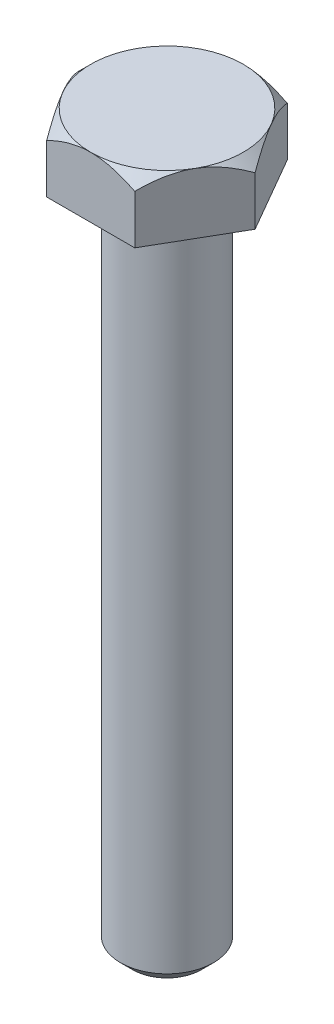
ISO-10303-21;
HEADER;
FILE_DESCRIPTION(('STEP AP214'),'2;1');
FILE_NAME('part.step','',(''),(''),'','','');
FILE_SCHEMA(('AUTOMOTIVE_DESIGN { 1 0 10303 214 1 1 1 1 }'));
ENDSEC;
DATA;
#1=APPLICATION_CONTEXT('core data for automotive mechanical design processes');
#2=APPLICATION_PROTOCOL_DEFINITION('international standard','automotive_design',2000,#1);
#3=PRODUCT_CONTEXT('',#1,'mechanical');
#4=PRODUCT('Part','Part','',(#3));
#5=PRODUCT_RELATED_PRODUCT_CATEGORY('part','',(#4));
#6=PRODUCT_DEFINITION_FORMATION('','',#4);
#7=PRODUCT_DEFINITION_CONTEXT('part definition',#1,'design');
#8=PRODUCT_DEFINITION('design','',#6,#7);
#9=PRODUCT_DEFINITION_SHAPE('','',#8);
#10=(LENGTH_UNIT() NAMED_UNIT(*) SI_UNIT(.MILLI.,.METRE.));
#11=(NAMED_UNIT(*) PLANE_ANGLE_UNIT() SI_UNIT($,.RADIAN.));
#12=(NAMED_UNIT(*) SI_UNIT($,.STERADIAN.) SOLID_ANGLE_UNIT());
#13=UNCERTAINTY_MEASURE_WITH_UNIT(LENGTH_MEASURE(1.E-05),#10,'distance_accuracy_value','');
#14=(GEOMETRIC_REPRESENTATION_CONTEXT(3) GLOBAL_UNCERTAINTY_ASSIGNED_CONTEXT((#13)) GLOBAL_UNIT_ASSIGNED_CONTEXT((#10,
#11,#12)) REPRESENTATION_CONTEXT('',''));
#15=CARTESIAN_POINT('',(0.,0.,0.));
#16=DIRECTION('',(0.,0.,1.));
#17=DIRECTION('',(1.,0.,0.));
#18=AXIS2_PLACEMENT_3D('',#15,#16,#17);
#19=CARTESIAN_POINT('',(3.62500000000007,5.,6.27868417743714));
#20=DIRECTION('',(-0.866025403784442,0.,-0.499999999999995));
#21=DIRECTION('',(-0.499999999999995,0.,0.866025403784442));
#22=AXIS2_PLACEMENT_3D('',#19,#20,#21);
#23=PLANE('',#22);
#24=CARTESIAN_POINT('',(3.62488452994624,4.02856870462476,6.27888417743714));
#25=CARTESIAN_POINT('',(3.68721389664161,4.0908916934917,6.17092654751716));
#26=CARTESIAN_POINT('',(3.75002235616352,4.15130208102734,6.06213910448007));
#27=CARTESIAN_POINT('',(3.87669145105401,4.2677158493395,5.84274179638098));
#28=CARTESIAN_POINT('',(3.94055263837515,4.32371682320785,5.73213097530909));
#29=CARTESIAN_POINT('',(4.13444955410337,4.48471046563524,5.39629166583691));
#30=CARTESIAN_POINT('',(4.26612670995196,4.58200705628878,5.16822014171098));
#31=CARTESIAN_POINT('',(4.53166422082633,4.74862075095615,4.70829568156119));
#32=CARTESIAN_POINT('',(4.66545670737727,4.81835760873348,4.47656029718399));
#33=CARTESIAN_POINT('',(4.86834501872006,4.89902600771869,4.12514743367641));
#34=CARTESIAN_POINT('',(4.93627316062514,4.92191520494596,4.00749244063306));
#35=CARTESIAN_POINT('',(5.07270459498125,4.95919667933445,3.77118626457879));
#36=CARTESIAN_POINT('',(5.14120779992591,4.97359022631844,3.65253523313333));
#37=CARTESIAN_POINT('',(5.30814078917526,4.99772308228725,3.3633988142941));
#38=CARTESIAN_POINT('',(5.40675043702598,5.0027866000747,3.19260189410018));
#39=CARTESIAN_POINT('',(5.60379200256286,4.99428769024785,2.85131589138739));
#40=CARTESIAN_POINT('',(5.70222384583931,4.98071873353769,2.68082693774991));
#41=CARTESIAN_POINT('',(5.89815953180448,4.9357547130673,2.34145637464237));
#42=CARTESIAN_POINT('',(5.99566221252046,4.9043397144273,2.17257677776813));
#43=CARTESIAN_POINT('',(6.18899174051392,4.82539152715257,1.83772021268014));
#44=CARTESIAN_POINT('',(6.28481871570106,4.77785957445157,1.67174302292037));
#45=CARTESIAN_POINT('',(6.45492849942725,4.68007191376467,1.37710423464204));
#46=CARTESIAN_POINT('',(6.52958798795453,4.63238802285783,1.2477902072457));
#47=CARTESIAN_POINT('',(6.67756674436656,4.52933616008443,0.991483482699198));
#48=CARTESIAN_POINT('',(6.75088597153632,4.47396795521828,0.864490856069481));
#49=CARTESIAN_POINT('',(6.89595327454856,4.35678861091045,0.613226916735296));
#50=CARTESIAN_POINT('',(6.96770547617939,4.29499773307909,0.488948457955774));
#51=CARTESIAN_POINT('',(7.10988123305974,4.16578428211806,0.24269282343444));
#52=CARTESIAN_POINT('',(7.18030557110013,4.09836516278837,0.120714291859081));
#53=CARTESIAN_POINT('',(7.25011547005384,4.02856870462477,-0.000200000000000499));
#54=B_SPLINE_CURVE_WITH_KNOTS('',3,(#24,#25,#26,#27,#28,#29,#30,#31,#32,#33,#34,#35,#36,#37,#38,
#39,#40,#41,#42,#43,#44,#45,#46,#47,#48,#49,#50,#51,#52,#53),.UNSPECIFIED.,.F.,.F.,(4,2,2,2,2,2,
2,2,2,2,2,2,2,2,4),(0.,0.418085081925561,0.83639681869771,1.67753646991016,2.50531966073267,
2.91839943514191,3.33141745194524,3.9223507147329,4.51349110216463,5.10529312372582,
5.69704977302065,6.16707290687592,6.63711029563191,7.10570744431351,7.57401912040438),.UNSPECIFIED.);
#55=CARTESIAN_POINT('',(3.62500000000007,4.02868417743718,6.27868417743714));
#56=VERTEX_POINT('',#55);
#57=CARTESIAN_POINT('',(5.43750000000002,5.,3.13934208871856));
#58=VERTEX_POINT('',#57);
#59=EDGE_CURVE('E110',#56,#58,#54,.T.);
#60=ORIENTED_EDGE('',*,*,#59,.F.);
#61=DIRECTION('',(0.,-1.,0.));
#62=VECTOR('',#61,1.);
#63=CARTESIAN_POINT('',(3.62500000000007,5.,6.27868417743714));
#64=LINE('',#63,#62);
#65=CARTESIAN_POINT('',(3.62500000000007,0.,6.27868417743714));
#66=VERTEX_POINT('',#65);
#67=EDGE_CURVE('E59',#56,#66,#64,.T.);
#68=ORIENTED_EDGE('',*,*,#67,.T.);
#69=DIRECTION('',(0.499999999999995,0.,-0.866025403784442));
#70=VECTOR('',#69,1.);
#71=CARTESIAN_POINT('',(3.62500000000007,0.,6.27868417743714));
#72=LINE('',#71,#70);
#73=CARTESIAN_POINT('',(7.25,0.,0.));
#74=VERTEX_POINT('',#73);
#75=EDGE_CURVE('E117',#66,#74,#72,.T.);
#76=ORIENTED_EDGE('',*,*,#75,.T.);
#77=DIRECTION('',(0.,-1.,0.));
#78=VECTOR('',#77,1.);
#79=CARTESIAN_POINT('',(7.25,5.,0.));
#80=LINE('',#79,#78);
#81=CARTESIAN_POINT('',(7.25,4.02868417743718,0.));
#82=VERTEX_POINT('',#81);
#83=EDGE_CURVE('E135',#82,#74,#80,.T.);
#84=ORIENTED_EDGE('',*,*,#83,.F.);
#85=EDGE_CURVE('E118',#58,#82,#54,.T.);
#86=ORIENTED_EDGE('',*,*,#85,.F.);
#87=EDGE_LOOP('',(#60,#68,#76,#84,#86));
#88=FACE_BOUND('',#87,.T.);
#89=ADVANCED_FACE('F36',(#88),#23,.F.);
#90=CARTESIAN_POINT('',(7.25,5.,0.));
#91=DIRECTION('',(-0.866025403784438,0.,0.500000000000001));
#92=DIRECTION('',(0.500000000000001,0.,0.866025403784438));
#93=AXIS2_PLACEMENT_3D('',#90,#91,#92);
#94=PLANE('',#93);
#95=CARTESIAN_POINT('',(7.25011547005384,4.02856870462477,0.000200000000000034));
#96=CARTESIAN_POINT('',(7.18778610335847,4.0908916934917,-0.107757629919975));
#97=CARTESIAN_POINT('',(7.12497764383655,4.15130208102734,-0.21654507295707));
#98=CARTESIAN_POINT('',(6.99830854894606,4.2677158493395,-0.435942381056166));
#99=CARTESIAN_POINT('',(6.93444736162492,4.32371682320785,-0.546553202128054));
#100=CARTESIAN_POINT('',(6.7405504458967,4.48471046563526,-0.882392511600232));
#101=CARTESIAN_POINT('',(6.6088732900481,4.58200705628879,-1.11046403572617));
#102=CARTESIAN_POINT('',(6.34333577917372,4.74862075095617,-1.57038849587596));
#103=CARTESIAN_POINT('',(6.20954329262278,4.8183576087335,-1.80212388025316));
#104=CARTESIAN_POINT('',(6.00665498127998,4.89902600771871,-2.15353674376074));
#105=CARTESIAN_POINT('',(5.9387268393749,4.92191520494598,-2.27119173680409));
#106=CARTESIAN_POINT('',(5.80229540501879,4.95919667933447,-2.50749791285837));
#107=CARTESIAN_POINT('',(5.73379220007413,4.97359022631846,-2.62614894430383));
#108=CARTESIAN_POINT('',(5.56685921082478,4.99772308228727,-2.91528536314305));
#109=CARTESIAN_POINT('',(5.46824956297406,5.00278660007473,-3.08608228333698));
#110=CARTESIAN_POINT('',(5.27120799743718,4.99428769024788,-3.42736828604976));
#111=CARTESIAN_POINT('',(5.17277615416072,4.98071873353772,-3.59785723968724));
#112=CARTESIAN_POINT('',(4.97684046819555,4.93575471306732,-3.93722780279478));
#113=CARTESIAN_POINT('',(4.87933778747957,4.90433971442733,-4.10610739966901));
#114=CARTESIAN_POINT('',(4.68600825948611,4.8253915271526,-4.44096396475701));
#115=CARTESIAN_POINT('',(4.59018128429897,4.7778595744516,-4.60694115451677));
#116=CARTESIAN_POINT('',(4.42007150057277,4.68007191376469,-4.9015799427951));
#117=CARTESIAN_POINT('',(4.34541201204549,4.63238802285786,-5.03089397019145));
#118=CARTESIAN_POINT('',(4.19743325563346,4.52933616008445,-5.28720069473796));
#119=CARTESIAN_POINT('',(4.12411402846369,4.4739679552183,-5.41419332136768));
#120=CARTESIAN_POINT('',(3.97904672545145,4.35678861091046,-5.66545726070187));
#121=CARTESIAN_POINT('',(3.90729452382061,4.2949977330791,-5.7897357194814));
#122=CARTESIAN_POINT('',(3.76511876694025,4.16578428211807,-6.03599135400274));
#123=CARTESIAN_POINT('',(3.69469442889986,4.09836516278837,-6.1579698855781));
#124=CARTESIAN_POINT('',(3.62488452994615,4.02856870462476,-6.27888417743719));
#125=B_SPLINE_CURVE_WITH_KNOTS('',3,(#95,#96,#97,#98,#99,#100,#101,#102,#103,#104,#105,#106,
#107,#108,#109,#110,#111,#112,#113,#114,#115,#116,#117,#118,#119,#120,#121,#122,#123,#124),
.UNSPECIFIED.,.F.,.F.,(4,2,2,2,2,2,2,2,2,2,2,2,2,2,4),(0.,0.418085081925567,0.83639681869772,
1.67753646991019,2.5053196607327,2.91839943514195,3.33141745194528,3.92235071473293,
4.51349110216466,5.10529312372585,5.69704977302068,6.16707290687597,6.63711029563198,
7.1057074443136,7.57401912040448),.UNSPECIFIED.);
#126=CARTESIAN_POINT('',(5.43749999999999,5.,-3.13934208871859));
#127=VERTEX_POINT('',#126);
#128=EDGE_CURVE('E125',#82,#127,#125,.T.);
#129=ORIENTED_EDGE('',*,*,#128,.F.);
#130=ORIENTED_EDGE('',*,*,#83,.T.);
#131=DIRECTION('',(-0.500000000000001,0.,-0.866025403784438));
#132=VECTOR('',#131,1.);
#133=CARTESIAN_POINT('',(7.25,0.,0.));
#134=LINE('',#133,#132);
#135=CARTESIAN_POINT('',(3.62499999999999,0.,-6.27868417743719));
#136=VERTEX_POINT('',#135);
#137=EDGE_CURVE('E398',#74,#136,#134,.T.);
#138=ORIENTED_EDGE('',*,*,#137,.T.);
#139=DIRECTION('',(0.,-1.,0.));
#140=VECTOR('',#139,1.);
#141=CARTESIAN_POINT('',(3.62499999999999,5.,-6.27868417743719));
#142=LINE('',#141,#140);
#143=CARTESIAN_POINT('',(3.62499999999999,4.02868417743718,-6.27868417743719));
#144=VERTEX_POINT('',#143);
#145=EDGE_CURVE('E204',#144,#136,#142,.T.);
#146=ORIENTED_EDGE('',*,*,#145,.F.);
#147=EDGE_CURVE('E136',#127,#144,#125,.T.);
#148=ORIENTED_EDGE('',*,*,#147,.F.);
#149=EDGE_LOOP('',(#129,#130,#138,#146,#148));
#150=FACE_BOUND('',#149,.T.);
#151=ADVANCED_FACE('F192',(#150),#94,.F.);
#152=CARTESIAN_POINT('',(3.62499999999999,5.,-6.27868417743719));
#153=DIRECTION('',(0.,0.,1.));
#154=DIRECTION('',(1.,0.,0.));
#155=AXIS2_PLACEMENT_3D('',#152,#153,#154);
#156=PLANE('',#155);
#157=CARTESIAN_POINT('',(-7.57666051860033,1.43857952280487,-6.27868417743715));
#158=CARTESIAN_POINT('',(-7.39365651230783,1.57945688959872,-6.27868417743715));
#159=CARTESIAN_POINT('',(-7.20966776392706,1.71907512434262,-6.27868417743715));
#160=CARTESIAN_POINT('',(-6.83931781583867,1.99521769306877,-6.27868417743715));
#161=CARTESIAN_POINT('',(-6.65295606622731,2.13174128876494,-6.27868417743715));
#162=CARTESIAN_POINT('',(-6.27609540777261,2.40209046760801,-6.27868417743715));
#163=CARTESIAN_POINT('',(-6.08557567548029,2.53588711812094,-6.27868417743715));
#164=CARTESIAN_POINT('',(-5.7013676758548,2.79883528544532,-6.27868417743716));
#165=CARTESIAN_POINT('',(-5.50767962786199,2.92798712185071,-6.27868417743716));
#166=CARTESIAN_POINT('',(-5.10415932230891,3.18862292545138,-6.27868417743716));
#167=CARTESIAN_POINT('',(-4.89408397797518,3.31973242959604,-6.27868417743716));
#168=CARTESIAN_POINT('',(-4.46899924146733,3.57382963916996,-6.27868417743716));
#169=CARTESIAN_POINT('',(-4.25398902548427,3.69681597506302,-6.27868417743716));
#170=CARTESIAN_POINT('',(-3.81897305439861,3.93204888921299,-6.27868417743716));
#171=CARTESIAN_POINT('',(-3.59898447967616,4.04432699068524,-6.27868417743716));
#172=CARTESIAN_POINT('',(-3.15278127156474,4.25562782816849,-6.27868417743717));
#173=CARTESIAN_POINT('',(-2.92656964053751,4.35465682564157,-6.27868417743717));
#174=CARTESIAN_POINT('',(-2.49021164331831,4.52687246842811,-6.27868417743717));
#175=CARTESIAN_POINT('',(-2.28069897147736,4.60164844585029,-6.27868417743717));
#176=CARTESIAN_POINT('',(-1.85632597962451,4.73443118921241,-6.27868417743717));
#177=CARTESIAN_POINT('',(-1.64146532079161,4.79243688972169,-6.27868417743717));
#178=CARTESIAN_POINT('',(-1.21142765694939,4.8875683886695,-6.27868417743717));
#179=CARTESIAN_POINT('',(-0.996336148218653,4.9250741683904,-6.27868417743717));
#180=CARTESIAN_POINT('',(-0.56346815275014,4.97842167925469,-6.27868417743717));
#181=CARTESIAN_POINT('',(-0.345692236177016,4.99426793349426,-6.27868417743717));
#182=CARTESIAN_POINT('',(0.0807362217716663,5.0029407360174,-6.27868417743718));
#183=CARTESIAN_POINT('',(0.289368982497101,4.99674859993676,-6.27868417743718));
#184=CARTESIAN_POINT('',(0.705011615215947,4.96394190845027,-6.27868417743718));
#185=CARTESIAN_POINT('',(0.912021338466265,4.9373255028629,-6.27868417743718));
#186=CARTESIAN_POINT('',(1.3264284221839,4.86472465401487,-6.27868417743718));
#187=CARTESIAN_POINT('',(1.53376477368789,4.81839783409703,-6.27868417743718));
#188=CARTESIAN_POINT('',(1.94386969783723,4.70894974197332,-6.27868417743718));
#189=CARTESIAN_POINT('',(2.14663852486609,4.64582940758558,-6.27868417743718));
#190=CARTESIAN_POINT('',(2.55855272468635,4.5016094654899,-6.27868417743719));
#191=CARTESIAN_POINT('',(2.76740928890636,4.41969434988626,-6.27868417743719));
#192=CARTESIAN_POINT('',(3.17975166734441,4.24320663783212,-6.27868417743719));
#193=CARTESIAN_POINT('',(3.38323501259331,4.14862833983322,-6.27868417743719));
#194=CARTESIAN_POINT('',(3.78579095692702,3.94905699505205,-6.27868417743719));
#195=CARTESIAN_POINT('',(3.98484753290937,3.84403189037483,-6.27868417743719));
#196=CARTESIAN_POINT('',(4.37839993765141,3.62587782327072,-6.27868417743719));
#197=CARTESIAN_POINT('',(4.57289646186356,3.51275010738356,-6.27868417743719));
#198=CARTESIAN_POINT('',(4.94842033299621,3.28571869098054,-6.27868417743719));
#199=CARTESIAN_POINT('',(5.12963857253774,3.17212907012057,-6.27868417743719));
#200=CARTESIAN_POINT('',(5.48896153359933,2.94011331347926,-6.2786841774372));
#201=CARTESIAN_POINT('',(5.66706602033122,2.82168681520702,-6.2786841774372));
#202=CARTESIAN_POINT('',(6.01913728036014,2.5818234603211,-6.2786841774372));
#203=CARTESIAN_POINT('',(6.19312579011556,2.46041839375126,-6.2786841774372));
#204=CARTESIAN_POINT('',(6.5387156854476,2.2143526316317,-6.2786841774372));
#205=CARTESIAN_POINT('',(6.71031771587599,2.08969284280949,-6.2786841774372));
#206=CARTESIAN_POINT('',(6.88091860823282,1.96370076934005,-6.2786841774372));
#207=B_SPLINE_CURVE_WITH_KNOTS('',3,(#157,#158,#159,#160,#161,#162,#163,#164,#165,#166,#167,
#168,#169,#170,#171,#172,#173,#174,#175,#176,#177,#178,#179,#180,#181,#182,#183,#184,#185,#186,
#187,#188,#189,#190,#191,#192,#193,#194,#195,#196,#197,#198,#199,#200,#201,#202,#203,#204,#205,
#206),.UNSPECIFIED.,.F.,.F.,(4,2,2,2,2,2,2,2,2,2,2,2,2,2,2,2,2,2,2,2,2,2,2,2,4),(0.,
0.692856158772512,1.38587590819399,2.0842410666755,2.78255808072084,3.52530650890354,
4.26817984375935,5.00879403011467,5.74905696003691,6.41585238613356,7.08269016503529,
7.73670784074358,8.39058891895184,9.01572562815278,9.64091897355062,10.2774464921539,
10.9139384719306,11.586461232698,12.2592878189047,12.9342468231889,13.6091022110665,
14.2506381722582,14.8922223007264,15.5286570401769,16.1649163294069),.UNSPECIFIED.);
#208=CARTESIAN_POINT('',(0.,5.,-6.27868417743718));
#209=VERTEX_POINT('',#208);
#210=EDGE_CURVE('E186',#144,#209,#207,.F.);
#211=ORIENTED_EDGE('',*,*,#210,.F.);
#212=ORIENTED_EDGE('',*,*,#145,.T.);
#213=DIRECTION('',(-1.,0.,0.));
#214=VECTOR('',#213,1.);
#215=CARTESIAN_POINT('',(3.62499999999999,0.,-6.27868417743719));
#216=LINE('',#215,#214);
#217=CARTESIAN_POINT('',(-3.62500000000003,0.,-6.27868417743716));
#218=VERTEX_POINT('',#217);
#219=EDGE_CURVE('E222',#136,#218,#216,.T.);
#220=ORIENTED_EDGE('',*,*,#219,.T.);
#221=DIRECTION('',(0.,-1.,0.));
#222=VECTOR('',#221,1.);
#223=CARTESIAN_POINT('',(-3.62500000000003,5.,-6.27868417743716));
#224=LINE('',#223,#222);
#225=CARTESIAN_POINT('',(-3.62500000000003,4.02868417743718,-6.27868417743716));
#226=VERTEX_POINT('',#225);
#227=EDGE_CURVE('E220',#226,#218,#224,.T.);
#228=ORIENTED_EDGE('',*,*,#227,.F.);
#229=EDGE_CURVE('E181',#209,#226,#207,.F.);
#230=ORIENTED_EDGE('',*,*,#229,.F.);
#231=EDGE_LOOP('',(#211,#212,#220,#228,#230));
#232=FACE_BOUND('',#231,.T.);
#233=ADVANCED_FACE('F188',(#232),#156,.F.);
#234=CARTESIAN_POINT('',(-3.62500000000003,5.,-6.27868417743716));
#235=DIRECTION('',(0.866025403784442,0.,0.499999999999995));
#236=DIRECTION('',(0.499999999999995,0.,-0.866025403784442));
#237=AXIS2_PLACEMENT_3D('',#234,#235,#236);
#238=PLANE('',#237);
#239=CARTESIAN_POINT('',(-3.62488452994619,4.02856870462477,-6.27888417743716));
#240=CARTESIAN_POINT('',(-3.68721389664156,4.0908916934917,-6.17092654751719));
#241=CARTESIAN_POINT('',(-3.75002235616348,4.15130208102734,-6.06213910448009));
#242=CARTESIAN_POINT('',(-3.87669145105397,4.2677158493395,-5.842741796381));
#243=CARTESIAN_POINT('',(-3.94055263837511,4.32371682320785,-5.73213097530911));
#244=CARTESIAN_POINT('',(-4.13444955410333,4.48471046563526,-5.39629166583693));
#245=CARTESIAN_POINT('',(-4.26612670995192,4.58200705628879,-5.16822014171099));
#246=CARTESIAN_POINT('',(-4.5316642208263,4.74862075095617,-4.7082956815612));
#247=CARTESIAN_POINT('',(-4.66545670737723,4.8183576087335,-4.476560297184));
#248=CARTESIAN_POINT('',(-4.86834501872003,4.89902600771871,-4.12514743367642));
#249=CARTESIAN_POINT('',(-4.93627316062511,4.92191520494598,-4.00749244063306));
#250=CARTESIAN_POINT('',(-5.07270459498122,4.95919667933447,-3.77118626457879));
#251=CARTESIAN_POINT('',(-5.14120779992588,4.97359022631847,-3.65253523313333));
#252=CARTESIAN_POINT('',(-5.30814078917523,4.99772308228727,-3.3633988142941));
#253=CARTESIAN_POINT('',(-5.40675043702595,5.00278660007473,-3.19260189410018));
#254=CARTESIAN_POINT('',(-5.60379200256283,4.99428769024788,-2.85131589138739));
#255=CARTESIAN_POINT('',(-5.70222384583928,4.98071873353772,-2.68082693774991));
#256=CARTESIAN_POINT('',(-5.89815953180445,4.93575471306732,-2.34145637464237));
#257=CARTESIAN_POINT('',(-5.99566221252043,4.90433971442733,-2.17257677776813));
#258=CARTESIAN_POINT('',(-6.18899174051389,4.8253915271526,-1.83772021268014));
#259=CARTESIAN_POINT('',(-6.28481871570103,4.7778595744516,-1.67174302292038));
#260=CARTESIAN_POINT('',(-6.45492849942722,4.68007191376469,-1.37710423464204));
#261=CARTESIAN_POINT('',(-6.5295879879545,4.63238802285786,-1.24779020724569));
#262=CARTESIAN_POINT('',(-6.67756674436654,4.52933616008446,-0.991483482699183));
#263=CARTESIAN_POINT('',(-6.7508859715363,4.4739679552183,-0.864490856069462));
#264=CARTESIAN_POINT('',(-6.89595327454855,4.35678861091046,-0.613226916735267));
#265=CARTESIAN_POINT('',(-6.96770547617938,4.2949977330791,-0.488948457955741));
#266=CARTESIAN_POINT('',(-7.10988123305973,4.16578428211807,-0.242692823434398));
#267=CARTESIAN_POINT('',(-7.18030557110012,4.09836516278837,-0.120714291859035));
#268=CARTESIAN_POINT('',(-7.25011547005384,4.02856870462476,0.000200000000050344));
#269=B_SPLINE_CURVE_WITH_KNOTS('',3,(#239,#240,#241,#242,#243,#244,#245,#246,#247,#248,#249,
#250,#251,#252,#253,#254,#255,#256,#257,#258,#259,#260,#261,#262,#263,#264,#265,#266,#267,#268),
.UNSPECIFIED.,.F.,.F.,(4,2,2,2,2,2,2,2,2,2,2,2,2,2,4),(0.,0.418085081925566,0.836396818697719,
1.67753646991018,2.5053196607327,2.91839943514195,3.33141745194527,3.92235071473293,
4.51349110216466,5.10529312372584,5.69704977302067,6.16707290687597,6.63711029563198,
7.1057074443136,7.57401912040448),.UNSPECIFIED.);
#270=CARTESIAN_POINT('',(-5.43750000000001,5.,-3.13934208871856));
#271=VERTEX_POINT('',#270);
#272=EDGE_CURVE('E187',#226,#271,#269,.T.);
#273=ORIENTED_EDGE('',*,*,#272,.F.);
#274=ORIENTED_EDGE('',*,*,#227,.T.);
#275=DIRECTION('',(-0.499999999999995,0.,0.866025403784441));
#276=VECTOR('',#275,1.);
#277=CARTESIAN_POINT('',(-3.62500000000003,0.,-6.27868417743716));
#278=LINE('',#277,#276);
#279=CARTESIAN_POINT('',(-7.25,0.,0.));
#280=VERTEX_POINT('',#279);
#281=EDGE_CURVE('E396',#218,#280,#278,.T.);
#282=ORIENTED_EDGE('',*,*,#281,.T.);
#283=DIRECTION('',(0.,-1.,0.));
#284=VECTOR('',#283,1.);
#285=CARTESIAN_POINT('',(-7.25,5.,0.));
#286=LINE('',#285,#284);
#287=CARTESIAN_POINT('',(-7.25,4.02868417743718,0.));
#288=VERTEX_POINT('',#287);
#289=EDGE_CURVE('E226',#288,#280,#286,.T.);
#290=ORIENTED_EDGE('',*,*,#289,.F.);
#291=EDGE_CURVE('E176',#271,#288,#269,.T.);
#292=ORIENTED_EDGE('',*,*,#291,.F.);
#293=EDGE_LOOP('',(#273,#274,#282,#290,#292));
#294=FACE_BOUND('',#293,.T.);
#295=ADVANCED_FACE('F191',(#294),#238,.F.);
#296=CARTESIAN_POINT('',(-7.25,5.,0.));
#297=DIRECTION('',(0.866025403784435,0.,-0.500000000000007));
#298=DIRECTION('',(-0.500000000000007,0.,-0.866025403784435));
#299=AXIS2_PLACEMENT_3D('',#296,#297,#298);
#300=PLANE('',#299);
#301=CARTESIAN_POINT('',(-7.25011547005384,4.02856870462477,-0.000199999999949406));
#302=CARTESIAN_POINT('',(-7.18778610335847,4.0908916934917,0.107757629920025));
#303=CARTESIAN_POINT('',(-7.12497764383655,4.15130208102734,0.216545072957119));
#304=CARTESIAN_POINT('',(-6.99830854894605,4.2677158493395,0.435942381056215));
#305=CARTESIAN_POINT('',(-6.93444736162491,4.32371682320785,0.546553202128102));
#306=CARTESIAN_POINT('',(-6.74055044589669,4.48471046563525,0.882392511600279));
#307=CARTESIAN_POINT('',(-6.60887329004809,4.58200705628879,1.11046403572621));
#308=CARTESIAN_POINT('',(-6.34333577917371,4.74862075095617,1.570388495876));
#309=CARTESIAN_POINT('',(-6.20954329262277,4.8183576087335,1.8021238802532));
#310=CARTESIAN_POINT('',(-6.00665498127997,4.89902600771871,2.15353674376078));
#311=CARTESIAN_POINT('',(-5.93872683937489,4.92191520494598,2.27119173680413));
#312=CARTESIAN_POINT('',(-5.80229540501878,4.95919667933447,2.50749791285841));
#313=CARTESIAN_POINT('',(-5.73379220007411,4.97359022631847,2.62614894430387));
#314=CARTESIAN_POINT('',(-5.56685921082476,4.99772308228727,2.91528536314309));
#315=CARTESIAN_POINT('',(-5.46824956297404,5.00278660007473,3.08608228333701));
#316=CARTESIAN_POINT('',(-5.27120799743715,4.99428769024788,3.4273682860498));
#317=CARTESIAN_POINT('',(-5.1727761541607,4.98071873353772,3.59785723968728));
#318=CARTESIAN_POINT('',(-4.97684046819552,4.93575471306732,3.93722780279481));
#319=CARTESIAN_POINT('',(-4.87933778747955,4.90433971442733,4.10610739966905));
#320=CARTESIAN_POINT('',(-4.68600825948608,4.8253915271526,4.44096396475704));
#321=CARTESIAN_POINT('',(-4.59018128429894,4.7778595744516,4.6069411545168));
#322=CARTESIAN_POINT('',(-4.42007150057274,4.68007191376469,4.90157994279513));
#323=CARTESIAN_POINT('',(-4.34541201204546,4.63238802285786,5.03089397019148));
#324=CARTESIAN_POINT('',(-4.19743325563342,4.52933616008446,5.28720069473799));
#325=CARTESIAN_POINT('',(-4.12411402846365,4.4739679552183,5.41419332136771));
#326=CARTESIAN_POINT('',(-3.9790467254514,4.35678861091047,5.6654572607019));
#327=CARTESIAN_POINT('',(-3.90729452382057,4.2949977330791,5.78973571948143));
#328=CARTESIAN_POINT('',(-3.76511876694021,4.16578428211807,6.03599135400277));
#329=CARTESIAN_POINT('',(-3.69469442889982,4.09836516278837,6.15796988557813));
#330=CARTESIAN_POINT('',(-3.6248845299461,4.02856870462477,6.27888417743721));
#331=B_SPLINE_CURVE_WITH_KNOTS('',3,(#301,#302,#303,#304,#305,#306,#307,#308,#309,#310,#311,
#312,#313,#314,#315,#316,#317,#318,#319,#320,#321,#322,#323,#324,#325,#326,#327,#328,#329,#330),
.UNSPECIFIED.,.F.,.F.,(4,2,2,2,2,2,2,2,2,2,2,2,2,2,4),(0.,0.418085081925566,0.836396818697719,
1.67753646991019,2.50531966073269,2.91839943514195,3.33141745194527,3.92235071473293,
4.51349110216466,5.10529312372585,5.69704977302068,6.16707290687597,6.63711029563198,
7.1057074443136,7.57401912040449),.UNSPECIFIED.);
#332=CARTESIAN_POINT('',(-5.43749999999997,5.,3.13934208871863));
#333=VERTEX_POINT('',#332);
#334=EDGE_CURVE('E381',#288,#333,#331,.T.);
#335=ORIENTED_EDGE('',*,*,#334,.F.);
#336=ORIENTED_EDGE('',*,*,#289,.T.);
#337=DIRECTION('',(0.500000000000007,0.,0.866025403784434));
#338=VECTOR('',#337,1.);
#339=CARTESIAN_POINT('',(-7.25,0.,0.));
#340=LINE('',#339,#338);
#341=CARTESIAN_POINT('',(-3.62499999999994,0.,6.27868417743721));
#342=VERTEX_POINT('',#341);
#343=EDGE_CURVE('E389',#280,#342,#340,.T.);
#344=ORIENTED_EDGE('',*,*,#343,.T.);
#345=DIRECTION('',(0.,-1.,0.));
#346=VECTOR('',#345,1.);
#347=CARTESIAN_POINT('',(-3.62499999999994,5.,6.27868417743721));
#348=LINE('',#347,#346);
#349=CARTESIAN_POINT('',(-3.62499999999994,4.02868417743718,6.27868417743721));
#350=VERTEX_POINT('',#349);
#351=EDGE_CURVE('E229',#350,#342,#348,.T.);
#352=ORIENTED_EDGE('',*,*,#351,.F.);
#353=EDGE_CURVE('E169',#333,#350,#331,.T.);
#354=ORIENTED_EDGE('',*,*,#353,.F.);
#355=EDGE_LOOP('',(#335,#336,#344,#352,#354));
#356=FACE_BOUND('',#355,.T.);
#357=ADVANCED_FACE('F309',(#356),#300,.F.);
#358=CARTESIAN_POINT('',(-3.62499999999994,5.,6.27868417743721));
#359=DIRECTION('',(0.,0.,-1.));
#360=DIRECTION('',(-1.,0.,0.));
#361=AXIS2_PLACEMENT_3D('',#358,#359,#360);
#362=PLANE('',#361);
#363=CARTESIAN_POINT('',(-7.57666051860024,1.43857952280487,6.27868417743725));
#364=CARTESIAN_POINT('',(-7.39365651230774,1.57945688959872,6.27868417743725));
#365=CARTESIAN_POINT('',(-7.20966776392697,1.71907512434262,6.27868417743725));
#366=CARTESIAN_POINT('',(-6.83931781583858,1.99521769306878,6.27868417743725));
#367=CARTESIAN_POINT('',(-6.65295606622722,2.13174128876494,6.27868417743725));
#368=CARTESIAN_POINT('',(-6.27609540777252,2.40209046760801,6.27868417743724));
#369=CARTESIAN_POINT('',(-6.0855756754802,2.53588711812094,6.27868417743724));
#370=CARTESIAN_POINT('',(-5.70136767585471,2.79883528544532,6.27868417743724));
#371=CARTESIAN_POINT('',(-5.50767962786191,2.92798712185071,6.27868417743723));
#372=CARTESIAN_POINT('',(-5.10415932230883,3.18862292545138,6.27868417743723));
#373=CARTESIAN_POINT('',(-4.89408397797509,3.31973242959604,6.27868417743723));
#374=CARTESIAN_POINT('',(-4.46899924146725,3.57382963916996,6.27868417743722));
#375=CARTESIAN_POINT('',(-4.25398902548418,3.69681597506302,6.27868417743722));
#376=CARTESIAN_POINT('',(-3.81897305439853,3.93204888921299,6.27868417743722));
#377=CARTESIAN_POINT('',(-3.59898447967608,4.04432699068524,6.27868417743721));
#378=CARTESIAN_POINT('',(-3.15278127156466,4.25562782816848,6.27868417743721));
#379=CARTESIAN_POINT('',(-2.92656964053743,4.35465682564157,6.27868417743721));
#380=CARTESIAN_POINT('',(-2.49021164331822,4.52687246842811,6.2786841774372));
#381=CARTESIAN_POINT('',(-2.28069897147728,4.60164844585029,6.2786841774372));
#382=CARTESIAN_POINT('',(-1.85632597962443,4.73443118921241,6.2786841774372));
#383=CARTESIAN_POINT('',(-1.64146532079152,4.79243688972169,6.27868417743719));
#384=CARTESIAN_POINT('',(-1.2114276569493,4.8875683886695,6.27868417743719));
#385=CARTESIAN_POINT('',(-0.996336148218567,4.9250741683904,6.27868417743719));
#386=CARTESIAN_POINT('',(-0.563468152750053,4.97842167925468,6.27868417743718));
#387=CARTESIAN_POINT('',(-0.345692236176929,4.99426793349426,6.27868417743718));
#388=CARTESIAN_POINT('',(0.0807362217717539,5.00294073601741,6.27868417743718));
#389=CARTESIAN_POINT('',(0.289368982497189,4.99674859993676,6.27868417743717));
#390=CARTESIAN_POINT('',(0.705011615216036,4.96394190845027,6.27868417743717));
#391=CARTESIAN_POINT('',(0.912021338466354,4.9373255028629,6.27868417743717));
#392=CARTESIAN_POINT('',(1.32642842218399,4.86472465401487,6.27868417743716));
#393=CARTESIAN_POINT('',(1.53376477368798,4.81839783409703,6.27868417743716));
#394=CARTESIAN_POINT('',(1.94386969783732,4.70894974197332,6.27868417743716));
#395=CARTESIAN_POINT('',(2.14663852486618,4.64582940758559,6.27868417743715));
#396=CARTESIAN_POINT('',(2.55855272468644,4.5016094654899,6.27868417743715));
#397=CARTESIAN_POINT('',(2.76740928890645,4.41969434988626,6.27868417743715));
#398=CARTESIAN_POINT('',(3.1797516673445,4.24320663783212,6.27868417743714));
#399=CARTESIAN_POINT('',(3.3832350125934,4.14862833983321,6.27868417743714));
#400=CARTESIAN_POINT('',(3.78579095692711,3.94905699505205,6.27868417743714));
#401=CARTESIAN_POINT('',(3.98484753290946,3.84403189037483,6.27868417743714));
#402=CARTESIAN_POINT('',(4.3783999376515,3.62587782327071,6.27868417743713));
#403=CARTESIAN_POINT('',(4.57289646186365,3.51275010738355,6.27868417743713));
#404=CARTESIAN_POINT('',(4.9484203329963,3.28571869098054,6.27868417743713));
#405=CARTESIAN_POINT('',(5.12963857253784,3.17212907012056,6.27868417743712));
#406=CARTESIAN_POINT('',(5.48896153359942,2.94011331347926,6.27868417743712));
#407=CARTESIAN_POINT('',(5.66706602033131,2.82168681520701,6.27868417743712));
#408=CARTESIAN_POINT('',(6.01913728036024,2.58182346032109,6.27868417743711));
#409=CARTESIAN_POINT('',(6.19312579011566,2.46041839375125,6.27868417743711));
#410=CARTESIAN_POINT('',(6.5387156854477,2.21435263163169,6.27868417743711));
#411=CARTESIAN_POINT('',(6.71031771587608,2.08969284280948,6.27868417743711));
#412=CARTESIAN_POINT('',(6.88091860823291,1.96370076934005,6.27868417743711));
#413=B_SPLINE_CURVE_WITH_KNOTS('',3,(#363,#364,#365,#366,#367,#368,#369,#370,#371,#372,#373,
#374,#375,#376,#377,#378,#379,#380,#381,#382,#383,#384,#385,#386,#387,#388,#389,#390,#391,#392,
#393,#394,#395,#396,#397,#398,#399,#400,#401,#402,#403,#404,#405,#406,#407,#408,#409,#410,#411,
#412),.UNSPECIFIED.,.F.,.F.,(4,2,2,2,2,2,2,2,2,2,2,2,2,2,2,2,2,2,2,2,2,2,2,2,4),(0.,
0.692856158772512,1.38587590819398,2.0842410666755,2.78255808072084,3.52530650890354,
4.26817984375935,5.00879403011467,5.7490569600369,6.41585238613355,7.08269016503529,
7.73670784074358,8.39058891895183,9.01572562815278,9.64091897355062,10.2774464921539,
10.9139384719306,11.586461232698,12.2592878189047,12.9342468231889,13.6091022110665,
14.2506381722582,14.8922223007265,15.5286570401769,16.1649163294069),.UNSPECIFIED.);
#414=CARTESIAN_POINT('',(0.,5.,6.27868417743717));
#415=VERTEX_POINT('',#414);
#416=EDGE_CURVE('E383',#350,#415,#413,.T.);
#417=ORIENTED_EDGE('',*,*,#416,.F.);
#418=ORIENTED_EDGE('',*,*,#351,.T.);
#419=DIRECTION('',(1.,0.,0.));
#420=VECTOR('',#419,1.);
#421=CARTESIAN_POINT('',(-3.62499999999994,0.,6.27868417743721));
#422=LINE('',#421,#420);
#423=EDGE_CURVE('E391',#342,#66,#422,.T.);
#424=ORIENTED_EDGE('',*,*,#423,.T.);
#425=ORIENTED_EDGE('',*,*,#67,.F.);
#426=EDGE_CURVE('E115',#415,#56,#413,.T.);
#427=ORIENTED_EDGE('',*,*,#426,.F.);
#428=EDGE_LOOP('',(#417,#418,#424,#425,#427));
#429=FACE_BOUND('',#428,.T.);
#430=ADVANCED_FACE('F302',(#429),#362,.F.);
#431=CARTESIAN_POINT('',(0.,0.,0.));
#432=DIRECTION('',(0.,1.,0.));
#433=DIRECTION('',(0.,0.,1.));
#434=AXIS2_PLACEMENT_3D('',#431,#432,#433);
#435=PLANE('',#434);
#436=CARTESIAN_POINT('',(0.,0.,0.));
#437=DIRECTION('',(0.,1.,0.));
#438=DIRECTION('',(0.,0.,1.));
#439=AXIS2_PLACEMENT_3D('',#436,#437,#438);
#440=CIRCLE('',#439,4.825);
#441=CARTESIAN_POINT('',(0.,0.,4.825));
#442=VERTEX_POINT('',#441);
#443=EDGE_CURVE('E236',#442,#442,#440,.T.);
#444=ORIENTED_EDGE('',*,*,#443,.T.);
#445=EDGE_LOOP('',(#444));
#446=FACE_BOUND('',#445,.T.);
#447=ORIENTED_EDGE('',*,*,#75,.F.);
#448=ORIENTED_EDGE('',*,*,#423,.F.);
#449=ORIENTED_EDGE('',*,*,#343,.F.);
#450=ORIENTED_EDGE('',*,*,#281,.F.);
#451=ORIENTED_EDGE('',*,*,#219,.F.);
#452=ORIENTED_EDGE('',*,*,#137,.F.);
#453=EDGE_LOOP('',(#447,#448,#449,#450,#451,#452));
#454=FACE_BOUND('',#453,.T.);
#455=ADVANCED_FACE('F295',(#446,#454),#435,.F.);
#456=CARTESIAN_POINT('',(0.,5.,0.));
#457=DIRECTION('',(0.,-1.,0.));
#458=DIRECTION('',(0.,0.,1.));
#459=AXIS2_PLACEMENT_3D('',#456,#457,#458);
#460=CONICAL_SURFACE('',#459,6.27868417743718,0.78539816339745);
#461=ORIENTED_EDGE('',*,*,#353,.T.);
#462=ORIENTED_EDGE('',*,*,#416,.T.);
#463=CARTESIAN_POINT('',(0.,5.,0.));
#464=DIRECTION('',(0.,1.,0.));
#465=DIRECTION('',(0.,0.,1.));
#466=AXIS2_PLACEMENT_3D('',#463,#464,#465);
#467=CIRCLE('',#466,6.27868417743718);
#468=EDGE_CURVE('E51',#333,#415,#467,.T.);
#469=ORIENTED_EDGE('',*,*,#468,.F.);
#470=EDGE_LOOP('',(#461,#462,#469));
#471=FACE_BOUND('',#470,.T.);
#472=ADVANCED_FACE('F155',(#471),#460,.T.);
#473=ORIENTED_EDGE('',*,*,#291,.T.);
#474=ORIENTED_EDGE('',*,*,#334,.T.);
#475=EDGE_CURVE('E217',#271,#333,#467,.T.);
#476=ORIENTED_EDGE('',*,*,#475,.F.);
#477=EDGE_LOOP('',(#473,#474,#476));
#478=FACE_BOUND('',#477,.T.);
#479=ADVANCED_FACE('F283',(#478),#460,.T.);
#480=ORIENTED_EDGE('',*,*,#229,.T.);
#481=ORIENTED_EDGE('',*,*,#272,.T.);
#482=EDGE_CURVE('E212',#209,#271,#467,.T.);
#483=ORIENTED_EDGE('',*,*,#482,.F.);
#484=EDGE_LOOP('',(#480,#481,#483));
#485=FACE_BOUND('',#484,.T.);
#486=ADVANCED_FACE('F213',(#485),#460,.T.);
#487=ORIENTED_EDGE('',*,*,#147,.T.);
#488=ORIENTED_EDGE('',*,*,#210,.T.);
#489=EDGE_CURVE('E130',#127,#209,#467,.T.);
#490=ORIENTED_EDGE('',*,*,#489,.F.);
#491=EDGE_LOOP('',(#487,#488,#490));
#492=FACE_BOUND('',#491,.T.);
#493=ADVANCED_FACE('F208',(#492),#460,.T.);
#494=ORIENTED_EDGE('',*,*,#85,.T.);
#495=ORIENTED_EDGE('',*,*,#128,.T.);
#496=EDGE_CURVE('E122',#58,#127,#467,.T.);
#497=ORIENTED_EDGE('',*,*,#496,.F.);
#498=EDGE_LOOP('',(#494,#495,#497));
#499=FACE_BOUND('',#498,.T.);
#500=ADVANCED_FACE('F123',(#499),#460,.T.);
#501=ORIENTED_EDGE('',*,*,#59,.T.);
#502=CARTESIAN_POINT('',(0.,5.,0.));
#503=DIRECTION('',(0.,1.,0.));
#504=DIRECTION('',(0.,0.,1.));
#505=AXIS2_PLACEMENT_3D('',#502,#503,#504);
#506=CIRCLE('',#505,6.27868417743718);
#507=EDGE_CURVE('E113',#415,#58,#506,.T.);
#508=ORIENTED_EDGE('',*,*,#507,.F.);
#509=ORIENTED_EDGE('',*,*,#426,.T.);
#510=EDGE_LOOP('',(#501,#508,#509));
#511=FACE_BOUND('',#510,.T.);
#512=ADVANCED_FACE('F112',(#511),#460,.T.);
#513=CARTESIAN_POINT('',(0.,5.,0.));
#514=DIRECTION('',(0.,1.,0.));
#515=DIRECTION('',(0.,0.,1.));
#516=AXIS2_PLACEMENT_3D('',#513,#514,#515);
#517=PLANE('',#516);
#518=ORIENTED_EDGE('',*,*,#468,.T.);
#519=ORIENTED_EDGE('',*,*,#507,.T.);
#520=ORIENTED_EDGE('',*,*,#496,.T.);
#521=ORIENTED_EDGE('',*,*,#489,.T.);
#522=ORIENTED_EDGE('',*,*,#482,.T.);
#523=ORIENTED_EDGE('',*,*,#475,.T.);
#524=EDGE_LOOP('',(#518,#519,#520,#521,#522,#523));
#525=FACE_BOUND('',#524,.T.);
#526=ADVANCED_FACE('F132',(#525),#517,.T.);
#527=CARTESIAN_POINT('',(0.,-55.,0.));
#528=DIRECTION('',(0.,1.,0.));
#529=DIRECTION('',(0.,0.,1.));
#530=AXIS2_PLACEMENT_3D('',#527,#528,#529);
#531=CYLINDRICAL_SURFACE('',#530,3.825);
#532=CARTESIAN_POINT('',(0.,-54.,0.));
#533=DIRECTION('',(0.,-1.,0.));
#534=DIRECTION('',(0.,0.,-1.));
#535=AXIS2_PLACEMENT_3D('',#532,#533,#534);
#536=CIRCLE('',#535,3.825);
#537=CARTESIAN_POINT('',(0.,-54.,-3.825));
#538=VERTEX_POINT('',#537);
#539=EDGE_CURVE('E12',#538,#538,#536,.F.);
#540=ORIENTED_EDGE('',*,*,#539,.T.);
#541=EDGE_LOOP('',(#540));
#542=FACE_BOUND('',#541,.T.);
#543=CARTESIAN_POINT('',(0.,-1.,0.));
#544=DIRECTION('',(0.,1.,0.));
#545=DIRECTION('',(0.,0.,1.));
#546=AXIS2_PLACEMENT_3D('',#543,#544,#545);
#547=CIRCLE('',#546,3.825);
#548=CARTESIAN_POINT('',(0.,-1.,3.825));
#549=VERTEX_POINT('',#548);
#550=EDGE_CURVE('E129',#549,#549,#547,.F.);
#551=ORIENTED_EDGE('',*,*,#550,.T.);
#552=EDGE_LOOP('',(#551));
#553=FACE_BOUND('',#552,.T.);
#554=ADVANCED_FACE('F156',(#542,#553),#531,.T.);
#555=CARTESIAN_POINT('',(0.,-55.,0.));
#556=DIRECTION('',(0.,-1.,0.));
#557=DIRECTION('',(0.,0.,-1.));
#558=AXIS2_PLACEMENT_3D('',#555,#556,#557);
#559=PLANE('',#558);
#560=CARTESIAN_POINT('',(0.,-55.,0.));
#561=DIRECTION('',(0.,-1.,0.));
#562=DIRECTION('',(0.,0.,-1.));
#563=AXIS2_PLACEMENT_3D('',#560,#561,#562);
#564=CIRCLE('',#563,2.82499999999999);
#565=CARTESIAN_POINT('',(0.,-55.,-2.82499999999999));
#566=VERTEX_POINT('',#565);
#567=EDGE_CURVE('E44',#566,#566,#564,.T.);
#568=ORIENTED_EDGE('',*,*,#567,.T.);
#569=EDGE_LOOP('',(#568));
#570=FACE_BOUND('',#569,.T.);
#571=ADVANCED_FACE('F241',(#570),#559,.T.);
#572=CARTESIAN_POINT('',(0.,-1.,0.));
#573=DIRECTION('',(0.,1.,0.));
#574=DIRECTION('',(0.,0.,1.));
#575=AXIS2_PLACEMENT_3D('',#572,#573,#574);
#576=TOROIDAL_SURFACE('',#575,4.825,1.);
#577=ORIENTED_EDGE('',*,*,#443,.F.);
#578=EDGE_LOOP('',(#577));
#579=FACE_BOUND('',#578,.T.);
#580=ORIENTED_EDGE('',*,*,#550,.F.);
#581=EDGE_LOOP('',(#580));
#582=FACE_BOUND('',#581,.T.);
#583=ADVANCED_FACE('F244',(#579,#582),#576,.F.);
#584=CARTESIAN_POINT('',(0.,-55.,0.));
#585=DIRECTION('',(0.,1.,0.));
#586=DIRECTION('',(0.,0.,1.));
#587=AXIS2_PLACEMENT_3D('',#584,#585,#586);
#588=CONICAL_SURFACE('',#587,2.82499999999999,0.785398163397447);
#589=ORIENTED_EDGE('',*,*,#539,.F.);
#590=EDGE_LOOP('',(#589));
#591=FACE_BOUND('',#590,.T.);
#592=ORIENTED_EDGE('',*,*,#567,.F.);
#593=EDGE_LOOP('',(#592));
#594=FACE_BOUND('',#593,.T.);
#595=ADVANCED_FACE('F38',(#591,#594),#588,.T.);
#596=CLOSED_SHELL('',(#89,#151,#233,#295,#357,#430,#455,#472,#479,#486,#493,#500,#512,#526,#554,
#571,#583,#595));
#597=MANIFOLD_SOLID_BREP('B2',#596);
#598=ADVANCED_BREP_SHAPE_REPRESENTATION('',(#18,#597),#14);
#599=SHAPE_DEFINITION_REPRESENTATION(#9,#598);
ENDSEC;
END-ISO-10303-21;
